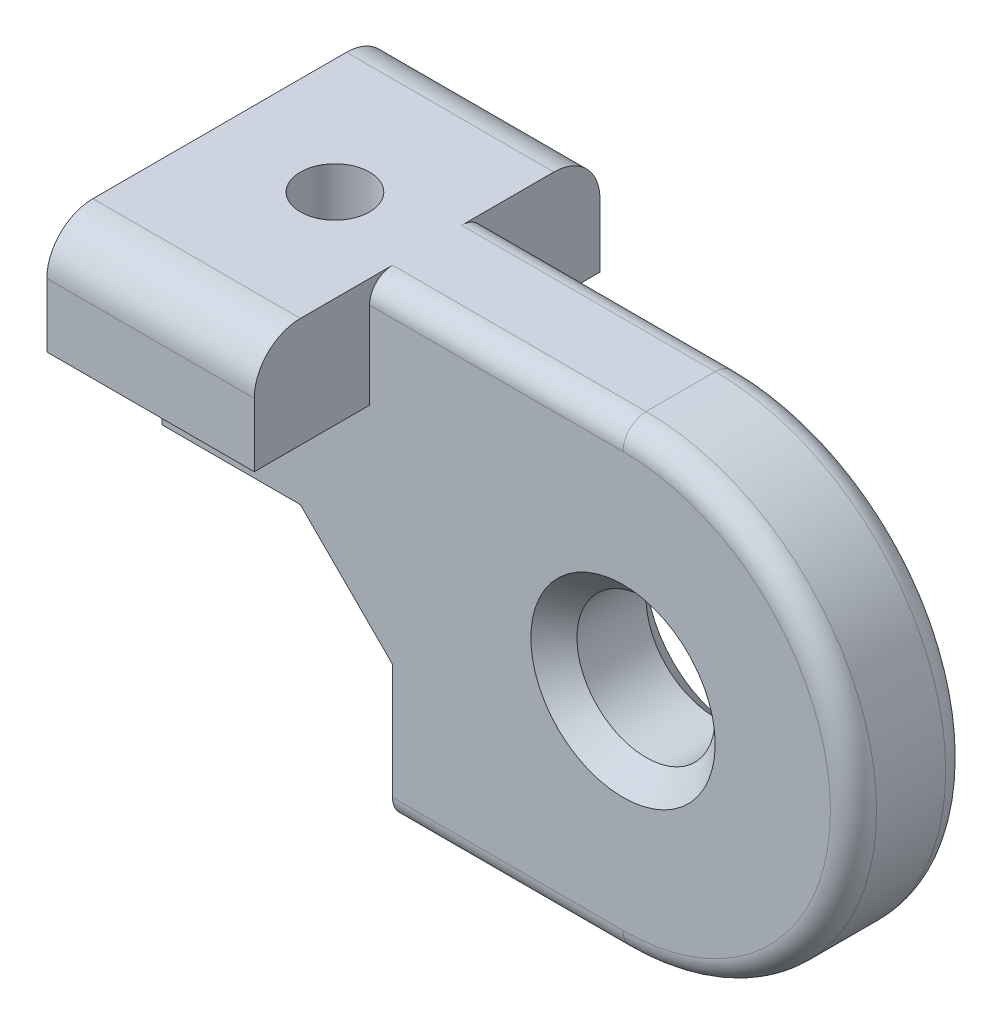
ISO-10303-21;
HEADER;
FILE_DESCRIPTION(('STEP AP214'),'2;1');
FILE_NAME('part.step','',(''),(''),'','','');
FILE_SCHEMA(('AUTOMOTIVE_DESIGN { 1 0 10303 214 1 1 1 1 }'));
ENDSEC;
DATA;
#1=APPLICATION_CONTEXT('core data for automotive mechanical design processes');
#2=APPLICATION_PROTOCOL_DEFINITION('international standard','automotive_design',2000,#1);
#3=PRODUCT_CONTEXT('',#1,'mechanical');
#4=PRODUCT('Part','Part','',(#3));
#5=PRODUCT_RELATED_PRODUCT_CATEGORY('part','',(#4));
#6=PRODUCT_DEFINITION_FORMATION('','',#4);
#7=PRODUCT_DEFINITION_CONTEXT('part definition',#1,'design');
#8=PRODUCT_DEFINITION('design','',#6,#7);
#9=PRODUCT_DEFINITION_SHAPE('','',#8);
#10=(LENGTH_UNIT() NAMED_UNIT(*) SI_UNIT(.MILLI.,.METRE.));
#11=(NAMED_UNIT(*) PLANE_ANGLE_UNIT() SI_UNIT($,.RADIAN.));
#12=(NAMED_UNIT(*) SI_UNIT($,.STERADIAN.) SOLID_ANGLE_UNIT());
#13=UNCERTAINTY_MEASURE_WITH_UNIT(LENGTH_MEASURE(1.E-05),#10,'distance_accuracy_value','');
#14=(GEOMETRIC_REPRESENTATION_CONTEXT(3) GLOBAL_UNCERTAINTY_ASSIGNED_CONTEXT((#13)) GLOBAL_UNIT_ASSIGNED_CONTEXT((#10,
#11,#12)) REPRESENTATION_CONTEXT('',''));
#15=CARTESIAN_POINT('',(0.,0.,0.));
#16=DIRECTION('',(0.,0.,1.));
#17=DIRECTION('',(1.,0.,0.));
#18=AXIS2_PLACEMENT_3D('',#15,#16,#17);
#19=CARTESIAN_POINT('',(0.,0.,2.5));
#20=DIRECTION('',(0.,0.,1.));
#21=DIRECTION('',(1.,0.,0.));
#22=AXIS2_PLACEMENT_3D('',#19,#20,#21);
#23=PLANE('',#22);
#24=DIRECTION('',(0.,-1.,0.));
#25=VECTOR('',#24,1.);
#26=CARTESIAN_POINT('',(-10.,-4.,2.5));
#27=LINE('',#26,#25);
#28=CARTESIAN_POINT('',(-10.,-4.,2.5));
#29=VERTEX_POINT('',#28);
#30=CARTESIAN_POINT('',(-10.,-9.,2.5));
#31=VERTEX_POINT('',#30);
#32=EDGE_CURVE('E297',#29,#31,#27,.T.);
#33=ORIENTED_EDGE('',*,*,#32,.T.);
#34=DIRECTION('',(1.,0.,0.));
#35=VECTOR('',#34,1.);
#36=CARTESIAN_POINT('',(0.,-9.,2.5));
#37=LINE('',#36,#35);
#38=CARTESIAN_POINT('',(0.,-9.,2.5));
#39=VERTEX_POINT('',#38);
#40=EDGE_CURVE('E247',#31,#39,#37,.T.);
#41=ORIENTED_EDGE('',*,*,#40,.T.);
#42=CARTESIAN_POINT('',(0.,0.,2.5));
#43=DIRECTION('',(0.,0.,1.));
#44=DIRECTION('',(1.,0.,0.));
#45=AXIS2_PLACEMENT_3D('',#42,#43,#44);
#46=CIRCLE('',#45,9.);
#47=CARTESIAN_POINT('',(0.,9.,2.5));
#48=VERTEX_POINT('',#47);
#49=EDGE_CURVE('E56',#39,#48,#46,.T.);
#50=ORIENTED_EDGE('',*,*,#49,.T.);
#51=DIRECTION('',(-1.,0.,0.));
#52=VECTOR('',#51,1.);
#53=CARTESIAN_POINT('',(-11.,9.,2.5));
#54=LINE('',#53,#52);
#55=CARTESIAN_POINT('',(-11.,9.,2.5));
#56=VERTEX_POINT('',#55);
#57=EDGE_CURVE('E245',#48,#56,#54,.T.);
#58=ORIENTED_EDGE('',*,*,#57,.T.);
#59=DIRECTION('',(0.,-1.,0.));
#60=VECTOR('',#59,1.);
#61=CARTESIAN_POINT('',(-11.,0.,2.5));
#62=LINE('',#61,#60);
#63=CARTESIAN_POINT('',(-11.,5.23809523809524,2.5));
#64=VERTEX_POINT('',#63);
#65=EDGE_CURVE('E275',#56,#64,#62,.T.);
#66=ORIENTED_EDGE('',*,*,#65,.T.);
#67=DIRECTION('',(-1.,0.,0.));
#68=VECTOR('',#67,1.);
#69=CARTESIAN_POINT('',(0.,5.23809523809524,2.5));
#70=LINE('',#69,#68);
#71=CARTESIAN_POINT('',(-20.,5.23809523809524,2.5));
#72=VERTEX_POINT('',#71);
#73=EDGE_CURVE('E289',#64,#72,#70,.T.);
#74=ORIENTED_EDGE('',*,*,#73,.T.);
#75=DIRECTION('',(0.,-1.,0.));
#76=VECTOR('',#75,1.);
#77=CARTESIAN_POINT('',(-20.,10.,2.5));
#78=LINE('',#77,#76);
#79=CARTESIAN_POINT('',(-20.,0.,2.5));
#80=VERTEX_POINT('',#79);
#81=EDGE_CURVE('E299',#72,#80,#78,.T.);
#82=ORIENTED_EDGE('',*,*,#81,.T.);
#83=DIRECTION('',(1.,0.,0.));
#84=VECTOR('',#83,1.);
#85=CARTESIAN_POINT('',(-20.,0.,2.5));
#86=LINE('',#85,#84);
#87=CARTESIAN_POINT('',(-14.,0.,2.5));
#88=VERTEX_POINT('',#87);
#89=EDGE_CURVE('E293',#80,#88,#86,.T.);
#90=ORIENTED_EDGE('',*,*,#89,.T.);
#91=DIRECTION('',(0.707106781186548,-0.707106781186548,0.));
#92=VECTOR('',#91,1.);
#93=CARTESIAN_POINT('',(-14.,0.,2.5));
#94=LINE('',#93,#92);
#95=EDGE_CURVE('E187',#88,#29,#94,.T.);
#96=ORIENTED_EDGE('',*,*,#95,.T.);
#97=EDGE_LOOP('',(#33,#41,#50,#58,#66,#74,#82,#90,#96));
#98=FACE_BOUND('',#97,.T.);
#99=CARTESIAN_POINT('',(0.,0.,2.5));
#100=DIRECTION('',(0.,0.,1.));
#101=DIRECTION('',(1.,0.,0.));
#102=AXIS2_PLACEMENT_3D('',#99,#100,#101);
#103=CIRCLE('',#102,4.00000000000001);
#104=CARTESIAN_POINT('',(4.00000000000001,0.,2.5));
#105=VERTEX_POINT('',#104);
#106=EDGE_CURVE('E221',#105,#105,#103,.F.);
#107=ORIENTED_EDGE('',*,*,#106,.T.);
#108=EDGE_LOOP('',(#107));
#109=FACE_BOUND('',#108,.T.);
#110=ADVANCED_FACE('F32',(#98,#109),#23,.T.);
#111=CARTESIAN_POINT('',(0.,0.,-2.5));
#112=DIRECTION('',(0.,0.,1.));
#113=DIRECTION('',(1.,0.,0.));
#114=AXIS2_PLACEMENT_3D('',#111,#112,#113);
#115=PLANE('',#114);
#116=CARTESIAN_POINT('',(0.,0.,-2.5));
#117=DIRECTION('',(0.,0.,1.));
#118=DIRECTION('',(1.,0.,0.));
#119=AXIS2_PLACEMENT_3D('',#116,#117,#118);
#120=CIRCLE('',#119,4.);
#121=CARTESIAN_POINT('',(4.,0.,-2.5));
#122=VERTEX_POINT('',#121);
#123=EDGE_CURVE('E212',#122,#122,#120,.T.);
#124=ORIENTED_EDGE('',*,*,#123,.T.);
#125=EDGE_LOOP('',(#124));
#126=FACE_BOUND('',#125,.T.);
#127=CARTESIAN_POINT('',(0.,0.,-2.5));
#128=DIRECTION('',(0.,0.,1.));
#129=DIRECTION('',(1.,0.,0.));
#130=AXIS2_PLACEMENT_3D('',#127,#128,#129);
#131=CIRCLE('',#130,9.);
#132=CARTESIAN_POINT('',(0.,9.,-2.5));
#133=VERTEX_POINT('',#132);
#134=CARTESIAN_POINT('',(0.,-9.,-2.5));
#135=VERTEX_POINT('',#134);
#136=EDGE_CURVE('E229',#133,#135,#131,.F.);
#137=ORIENTED_EDGE('',*,*,#136,.T.);
#138=DIRECTION('',(1.,0.,0.));
#139=VECTOR('',#138,1.);
#140=CARTESIAN_POINT('',(0.,-9.,-2.5));
#141=LINE('',#140,#139);
#142=CARTESIAN_POINT('',(-10.,-9.,-2.5));
#143=VERTEX_POINT('',#142);
#144=EDGE_CURVE('E233',#135,#143,#141,.F.);
#145=ORIENTED_EDGE('',*,*,#144,.T.);
#146=DIRECTION('',(0.,-1.,0.));
#147=VECTOR('',#146,1.);
#148=CARTESIAN_POINT('',(-10.,-4.,-2.5));
#149=LINE('',#148,#147);
#150=CARTESIAN_POINT('',(-10.,-4.,-2.5));
#151=VERTEX_POINT('',#150);
#152=EDGE_CURVE('E303',#151,#143,#149,.T.);
#153=ORIENTED_EDGE('',*,*,#152,.F.);
#154=DIRECTION('',(0.707106781186548,-0.707106781186548,0.));
#155=VECTOR('',#154,1.);
#156=CARTESIAN_POINT('',(-14.,0.,-2.5));
#157=LINE('',#156,#155);
#158=CARTESIAN_POINT('',(-14.,0.,-2.5));
#159=VERTEX_POINT('',#158);
#160=EDGE_CURVE('E287',#159,#151,#157,.T.);
#161=ORIENTED_EDGE('',*,*,#160,.F.);
#162=DIRECTION('',(1.,0.,0.));
#163=VECTOR('',#162,1.);
#164=CARTESIAN_POINT('',(-20.,0.,-2.5));
#165=LINE('',#164,#163);
#166=CARTESIAN_POINT('',(-20.,0.,-2.5));
#167=VERTEX_POINT('',#166);
#168=EDGE_CURVE('E284',#167,#159,#165,.T.);
#169=ORIENTED_EDGE('',*,*,#168,.F.);
#170=DIRECTION('',(0.,-1.,0.));
#171=VECTOR('',#170,1.);
#172=CARTESIAN_POINT('',(-20.,10.,-2.5));
#173=LINE('',#172,#171);
#174=CARTESIAN_POINT('',(-20.,5.23809523809524,-2.5));
#175=VERTEX_POINT('',#174);
#176=EDGE_CURVE('E295',#175,#167,#173,.T.);
#177=ORIENTED_EDGE('',*,*,#176,.F.);
#178=DIRECTION('',(-1.,0.,0.));
#179=VECTOR('',#178,1.);
#180=CARTESIAN_POINT('',(0.,5.23809523809524,-2.5));
#181=LINE('',#180,#179);
#182=CARTESIAN_POINT('',(-11.,5.23809523809524,-2.5));
#183=VERTEX_POINT('',#182);
#184=EDGE_CURVE('E361',#183,#175,#181,.T.);
#185=ORIENTED_EDGE('',*,*,#184,.F.);
#186=DIRECTION('',(0.,-1.,0.));
#187=VECTOR('',#186,1.);
#188=CARTESIAN_POINT('',(-11.,0.,-2.5));
#189=LINE('',#188,#187);
#190=CARTESIAN_POINT('',(-11.,9.,-2.5));
#191=VERTEX_POINT('',#190);
#192=EDGE_CURVE('E285',#191,#183,#189,.T.);
#193=ORIENTED_EDGE('',*,*,#192,.F.);
#194=DIRECTION('',(-1.,0.,0.));
#195=VECTOR('',#194,1.);
#196=CARTESIAN_POINT('',(0.,9.,-2.5));
#197=LINE('',#196,#195);
#198=EDGE_CURVE('E231',#191,#133,#197,.F.);
#199=ORIENTED_EDGE('',*,*,#198,.T.);
#200=EDGE_LOOP('',(#137,#145,#153,#161,#169,#177,#185,#193,#199));
#201=FACE_BOUND('',#200,.T.);
#202=ADVANCED_FACE('F330',(#126,#201),#115,.F.);
#203=CARTESIAN_POINT('',(-20.,0.,2.5));
#204=DIRECTION('',(0.,1.,0.));
#205=DIRECTION('',(0.,0.,1.));
#206=AXIS2_PLACEMENT_3D('',#203,#204,#205);
#207=PLANE('',#206);
#208=DIRECTION('',(0.,0.,-1.));
#209=VECTOR('',#208,1.);
#210=CARTESIAN_POINT('',(-14.,0.,2.5));
#211=LINE('',#210,#209);
#212=CARTESIAN_POINT('',(-14.,0.,-1.1180339887499));
#213=VERTEX_POINT('',#212);
#214=EDGE_CURVE('E182',#213,#159,#211,.T.);
#215=ORIENTED_EDGE('',*,*,#214,.F.);
#216=CARTESIAN_POINT('',(-15.,0.,0.));
#217=DIRECTION('',(0.,1.,0.));
#218=DIRECTION('',(0.,0.,1.));
#219=AXIS2_PLACEMENT_3D('',#216,#217,#218);
#220=CIRCLE('',#219,1.5);
#221=CARTESIAN_POINT('',(-14.,0.,1.1180339887499));
#222=VERTEX_POINT('',#221);
#223=EDGE_CURVE('E48',#213,#222,#220,.T.);
#224=ORIENTED_EDGE('',*,*,#223,.T.);
#225=EDGE_CURVE('E180',#88,#222,#211,.T.);
#226=ORIENTED_EDGE('',*,*,#225,.F.);
#227=ORIENTED_EDGE('',*,*,#89,.F.);
#228=DIRECTION('',(0.,0.,-1.));
#229=VECTOR('',#228,1.);
#230=CARTESIAN_POINT('',(-20.,0.,2.5));
#231=LINE('',#230,#229);
#232=EDGE_CURVE('E300',#80,#167,#231,.T.);
#233=ORIENTED_EDGE('',*,*,#232,.T.);
#234=ORIENTED_EDGE('',*,*,#168,.T.);
#235=EDGE_LOOP('',(#215,#224,#226,#227,#233,#234));
#236=FACE_BOUND('',#235,.T.);
#237=ADVANCED_FACE('F178',(#236),#207,.F.);
#238=CARTESIAN_POINT('',(-14.,0.,2.5));
#239=DIRECTION('',(0.707106781186548,0.707106781186548,0.));
#240=DIRECTION('',(-0.707106781186548,0.707106781186548,0.));
#241=AXIS2_PLACEMENT_3D('',#238,#239,#240);
#242=PLANE('',#241);
#243=ORIENTED_EDGE('',*,*,#225,.T.);
#244=CARTESIAN_POINT('',(-15.,0.999999999999999,0.));
#245=DIRECTION('',(0.707106781186548,0.707106781186548,0.));
#246=DIRECTION('',(-0.707106781186548,0.707106781186548,0.));
#247=AXIS2_PLACEMENT_3D('',#244,#245,#246);
#248=ELLIPSE('',#247,2.12132034355964,1.5);
#249=EDGE_CURVE('E169',#222,#213,#248,.T.);
#250=ORIENTED_EDGE('',*,*,#249,.T.);
#251=ORIENTED_EDGE('',*,*,#214,.T.);
#252=ORIENTED_EDGE('',*,*,#160,.T.);
#253=DIRECTION('',(0.,0.,-1.));
#254=VECTOR('',#253,1.);
#255=CARTESIAN_POINT('',(-10.,-4.,2.5));
#256=LINE('',#255,#254);
#257=EDGE_CURVE('E193',#29,#151,#256,.T.);
#258=ORIENTED_EDGE('',*,*,#257,.F.);
#259=ORIENTED_EDGE('',*,*,#95,.F.);
#260=EDGE_LOOP('',(#243,#250,#251,#252,#258,#259));
#261=FACE_BOUND('',#260,.T.);
#262=ADVANCED_FACE('F185',(#261),#242,.F.);
#263=CARTESIAN_POINT('',(-10.,-4.,2.5));
#264=DIRECTION('',(1.,0.,0.));
#265=DIRECTION('',(0.,0.,-1.));
#266=AXIS2_PLACEMENT_3D('',#263,#264,#265);
#267=PLANE('',#266);
#268=ORIENTED_EDGE('',*,*,#152,.T.);
#269=CARTESIAN_POINT('',(-10.,-9.,-1.5));
#270=DIRECTION('',(1.,0.,0.));
#271=DIRECTION('',(0.,0.,-1.));
#272=AXIS2_PLACEMENT_3D('',#269,#270,#271);
#273=CIRCLE('',#272,1.);
#274=CARTESIAN_POINT('',(-10.,-10.,-1.5));
#275=VERTEX_POINT('',#274);
#276=EDGE_CURVE('E237',#143,#275,#273,.F.);
#277=ORIENTED_EDGE('',*,*,#276,.T.);
#278=DIRECTION('',(0.,0.,-1.));
#279=VECTOR('',#278,1.);
#280=CARTESIAN_POINT('',(-10.,-10.,2.5));
#281=LINE('',#280,#279);
#282=CARTESIAN_POINT('',(-10.,-10.,1.5));
#283=VERTEX_POINT('',#282);
#284=EDGE_CURVE('E317',#283,#275,#281,.T.);
#285=ORIENTED_EDGE('',*,*,#284,.F.);
#286=CARTESIAN_POINT('',(-10.,-9.,1.5));
#287=DIRECTION('',(1.,0.,0.));
#288=DIRECTION('',(0.,0.,-1.));
#289=AXIS2_PLACEMENT_3D('',#286,#287,#288);
#290=CIRCLE('',#289,1.);
#291=EDGE_CURVE('E235',#283,#31,#290,.F.);
#292=ORIENTED_EDGE('',*,*,#291,.T.);
#293=ORIENTED_EDGE('',*,*,#32,.F.);
#294=ORIENTED_EDGE('',*,*,#257,.T.);
#295=EDGE_LOOP('',(#268,#277,#285,#292,#293,#294));
#296=FACE_BOUND('',#295,.T.);
#297=ADVANCED_FACE('F326',(#296),#267,.F.);
#298=CARTESIAN_POINT('',(-10.,-10.,2.5));
#299=DIRECTION('',(0.,1.,0.));
#300=DIRECTION('',(0.,0.,1.));
#301=AXIS2_PLACEMENT_3D('',#298,#299,#300);
#302=PLANE('',#301);
#303=ORIENTED_EDGE('',*,*,#284,.T.);
#304=DIRECTION('',(1.,0.,0.));
#305=VECTOR('',#304,1.);
#306=CARTESIAN_POINT('',(-10.,-10.,-1.5));
#307=LINE('',#306,#305);
#308=CARTESIAN_POINT('',(0.,-10.,-1.5));
#309=VERTEX_POINT('',#308);
#310=EDGE_CURVE('E226',#275,#309,#307,.T.);
#311=ORIENTED_EDGE('',*,*,#310,.T.);
#312=DIRECTION('',(0.,0.,-1.));
#313=VECTOR('',#312,1.);
#314=CARTESIAN_POINT('',(0.,-10.,2.5));
#315=LINE('',#314,#313);
#316=CARTESIAN_POINT('',(0.,-10.,1.5));
#317=VERTEX_POINT('',#316);
#318=EDGE_CURVE('E315',#317,#309,#315,.T.);
#319=ORIENTED_EDGE('',*,*,#318,.F.);
#320=DIRECTION('',(1.,0.,0.));
#321=VECTOR('',#320,1.);
#322=CARTESIAN_POINT('',(-10.,-10.,1.5));
#323=LINE('',#322,#321);
#324=EDGE_CURVE('E224',#317,#283,#323,.F.);
#325=ORIENTED_EDGE('',*,*,#324,.T.);
#326=EDGE_LOOP('',(#303,#311,#319,#325));
#327=FACE_BOUND('',#326,.T.);
#328=ADVANCED_FACE('F344',(#327),#302,.F.);
#329=CARTESIAN_POINT('',(0.,0.,2.5));
#330=DIRECTION('',(0.,0.,-1.));
#331=DIRECTION('',(-1.,0.,0.));
#332=AXIS2_PLACEMENT_3D('',#329,#330,#331);
#333=CYLINDRICAL_SURFACE('',#332,10.);
#334=ORIENTED_EDGE('',*,*,#318,.T.);
#335=CARTESIAN_POINT('',(0.,0.,-1.5));
#336=DIRECTION('',(0.,0.,1.));
#337=DIRECTION('',(1.,0.,0.));
#338=AXIS2_PLACEMENT_3D('',#335,#336,#337);
#339=CIRCLE('',#338,10.);
#340=CARTESIAN_POINT('',(0.,10.,-1.5));
#341=VERTEX_POINT('',#340);
#342=EDGE_CURVE('E251',#309,#341,#339,.T.);
#343=ORIENTED_EDGE('',*,*,#342,.T.);
#344=DIRECTION('',(0.,0.,-1.));
#345=VECTOR('',#344,1.);
#346=CARTESIAN_POINT('',(0.,10.,2.5));
#347=LINE('',#346,#345);
#348=CARTESIAN_POINT('',(0.,10.,1.5));
#349=VERTEX_POINT('',#348);
#350=EDGE_CURVE('E312',#349,#341,#347,.T.);
#351=ORIENTED_EDGE('',*,*,#350,.F.);
#352=CARTESIAN_POINT('',(0.,0.,1.5));
#353=DIRECTION('',(0.,0.,1.));
#354=DIRECTION('',(1.,0.,0.));
#355=AXIS2_PLACEMENT_3D('',#352,#353,#354);
#356=CIRCLE('',#355,10.);
#357=EDGE_CURVE('E249',#349,#317,#356,.F.);
#358=ORIENTED_EDGE('',*,*,#357,.T.);
#359=EDGE_LOOP('',(#334,#343,#351,#358));
#360=FACE_BOUND('',#359,.T.);
#361=ADVANCED_FACE('F345',(#360),#333,.T.);
#362=CARTESIAN_POINT('',(0.,10.,2.5));
#363=DIRECTION('',(0.,-1.,0.));
#364=DIRECTION('',(0.,0.,-1.));
#365=AXIS2_PLACEMENT_3D('',#362,#363,#364);
#366=PLANE('',#365);
#367=CARTESIAN_POINT('',(-15.,10.,0.));
#368=DIRECTION('',(0.,1.,0.));
#369=DIRECTION('',(0.,0.,1.));
#370=AXIS2_PLACEMENT_3D('',#367,#368,#369);
#371=CIRCLE('',#370,1.5);
#372=CARTESIAN_POINT('',(-15.,10.,1.5));
#373=VERTEX_POINT('',#372);
#374=EDGE_CURVE('E174',#373,#373,#371,.T.);
#375=ORIENTED_EDGE('',*,*,#374,.F.);
#376=EDGE_LOOP('',(#375));
#377=FACE_BOUND('',#376,.T.);
#378=ORIENTED_EDGE('',*,*,#350,.T.);
#379=DIRECTION('',(-1.,0.,0.));
#380=VECTOR('',#379,1.);
#381=CARTESIAN_POINT('',(0.,10.,-1.5));
#382=LINE('',#381,#380);
#383=CARTESIAN_POINT('',(-11.,10.,-1.5));
#384=VERTEX_POINT('',#383);
#385=EDGE_CURVE('E241',#341,#384,#382,.T.);
#386=ORIENTED_EDGE('',*,*,#385,.T.);
#387=DIRECTION('',(0.,0.,-1.));
#388=VECTOR('',#387,1.);
#389=CARTESIAN_POINT('',(-11.,10.,7.5));
#390=LINE('',#389,#388);
#391=CARTESIAN_POINT('',(-11.,10.,-5.5));
#392=VERTEX_POINT('',#391);
#393=EDGE_CURVE('E359',#384,#392,#390,.T.);
#394=ORIENTED_EDGE('',*,*,#393,.T.);
#395=DIRECTION('',(-1.,0.,0.));
#396=VECTOR('',#395,1.);
#397=CARTESIAN_POINT('',(0.,10.,-5.5));
#398=LINE('',#397,#396);
#399=CARTESIAN_POINT('',(-20.,10.,-5.5));
#400=VERTEX_POINT('',#399);
#401=EDGE_CURVE('E191',#392,#400,#398,.T.);
#402=ORIENTED_EDGE('',*,*,#401,.T.);
#403=DIRECTION('',(0.,0.,-1.));
#404=VECTOR('',#403,1.);
#405=CARTESIAN_POINT('',(-20.,10.,2.5));
#406=LINE('',#405,#404);
#407=CARTESIAN_POINT('',(-20.,10.,5.5));
#408=VERTEX_POINT('',#407);
#409=EDGE_CURVE('E309',#408,#400,#406,.T.);
#410=ORIENTED_EDGE('',*,*,#409,.F.);
#411=DIRECTION('',(-1.,0.,0.));
#412=VECTOR('',#411,1.);
#413=CARTESIAN_POINT('',(-11.,10.,5.5));
#414=LINE('',#413,#412);
#415=CARTESIAN_POINT('',(-11.,10.,5.5));
#416=VERTEX_POINT('',#415);
#417=EDGE_CURVE('E189',#408,#416,#414,.F.);
#418=ORIENTED_EDGE('',*,*,#417,.T.);
#419=CARTESIAN_POINT('',(-11.,10.,1.5));
#420=VERTEX_POINT('',#419);
#421=EDGE_CURVE('E374',#416,#420,#390,.T.);
#422=ORIENTED_EDGE('',*,*,#421,.T.);
#423=DIRECTION('',(-1.,0.,0.));
#424=VECTOR('',#423,1.);
#425=CARTESIAN_POINT('',(0.,10.,1.5));
#426=LINE('',#425,#424);
#427=EDGE_CURVE('E239',#420,#349,#426,.F.);
#428=ORIENTED_EDGE('',*,*,#427,.T.);
#429=EDGE_LOOP('',(#378,#386,#394,#402,#410,#418,#422,#428));
#430=FACE_BOUND('',#429,.T.);
#431=ADVANCED_FACE('F348',(#377,#430),#366,.F.);
#432=CARTESIAN_POINT('',(-20.,10.,2.5));
#433=DIRECTION('',(1.,0.,0.));
#434=DIRECTION('',(0.,0.,-1.));
#435=AXIS2_PLACEMENT_3D('',#432,#433,#434);
#436=PLANE('',#435);
#437=ORIENTED_EDGE('',*,*,#409,.T.);
#438=CARTESIAN_POINT('',(-20.,8.,-5.5));
#439=DIRECTION('',(1.,0.,0.));
#440=DIRECTION('',(0.,0.,-1.));
#441=AXIS2_PLACEMENT_3D('',#438,#439,#440);
#442=CIRCLE('',#441,2.);
#443=CARTESIAN_POINT('',(-20.,8.,-7.5));
#444=VERTEX_POINT('',#443);
#445=EDGE_CURVE('E201',#400,#444,#442,.F.);
#446=ORIENTED_EDGE('',*,*,#445,.T.);
#447=DIRECTION('',(0.,-1.,0.));
#448=VECTOR('',#447,1.);
#449=CARTESIAN_POINT('',(-20.,10.,-7.5));
#450=LINE('',#449,#448);
#451=CARTESIAN_POINT('',(-20.,5.23809523809524,-7.5));
#452=VERTEX_POINT('',#451);
#453=EDGE_CURVE('E258',#444,#452,#450,.T.);
#454=ORIENTED_EDGE('',*,*,#453,.T.);
#455=DIRECTION('',(0.,0.,-1.));
#456=VECTOR('',#455,1.);
#457=CARTESIAN_POINT('',(-20.,5.23809523809524,7.5));
#458=LINE('',#457,#456);
#459=EDGE_CURVE('E376',#175,#452,#458,.T.);
#460=ORIENTED_EDGE('',*,*,#459,.F.);
#461=ORIENTED_EDGE('',*,*,#176,.T.);
#462=ORIENTED_EDGE('',*,*,#232,.F.);
#463=ORIENTED_EDGE('',*,*,#81,.F.);
#464=CARTESIAN_POINT('',(-20.,5.23809523809524,7.5));
#465=VERTEX_POINT('',#464);
#466=EDGE_CURVE('E366',#465,#72,#458,.T.);
#467=ORIENTED_EDGE('',*,*,#466,.F.);
#468=DIRECTION('',(0.,-1.,0.));
#469=VECTOR('',#468,1.);
#470=CARTESIAN_POINT('',(-20.,10.,7.5));
#471=LINE('',#470,#469);
#472=CARTESIAN_POINT('',(-20.,8.,7.5));
#473=VERTEX_POINT('',#472);
#474=EDGE_CURVE('E634',#473,#465,#471,.T.);
#475=ORIENTED_EDGE('',*,*,#474,.F.);
#476=CARTESIAN_POINT('',(-20.,8.,5.5));
#477=DIRECTION('',(1.,0.,0.));
#478=DIRECTION('',(0.,0.,-1.));
#479=AXIS2_PLACEMENT_3D('',#476,#477,#478);
#480=CIRCLE('',#479,2.);
#481=EDGE_CURVE('E199',#473,#408,#480,.F.);
#482=ORIENTED_EDGE('',*,*,#481,.T.);
#483=EDGE_LOOP('',(#437,#446,#454,#460,#461,#462,#463,#467,#475,#482));
#484=FACE_BOUND('',#483,.T.);
#485=ADVANCED_FACE('F385',(#484),#436,.F.);
#486=CARTESIAN_POINT('',(0.,0.,2.5));
#487=DIRECTION('',(0.,0.,-1.));
#488=DIRECTION('',(-1.,0.,0.));
#489=AXIS2_PLACEMENT_3D('',#486,#487,#488);
#490=CYLINDRICAL_SURFACE('',#489,3.);
#491=CARTESIAN_POINT('',(0.,0.,-1.5));
#492=DIRECTION('',(0.,0.,1.));
#493=DIRECTION('',(1.,0.,0.));
#494=AXIS2_PLACEMENT_3D('',#491,#492,#493);
#495=CIRCLE('',#494,3.);
#496=CARTESIAN_POINT('',(3.,0.,-1.5));
#497=VERTEX_POINT('',#496);
#498=EDGE_CURVE('E218',#497,#497,#495,.F.);
#499=ORIENTED_EDGE('',*,*,#498,.T.);
#500=EDGE_LOOP('',(#499));
#501=FACE_BOUND('',#500,.T.);
#502=CARTESIAN_POINT('',(0.,0.,1.5));
#503=DIRECTION('',(0.,0.,1.));
#504=DIRECTION('',(1.,0.,0.));
#505=AXIS2_PLACEMENT_3D('',#502,#503,#504);
#506=CIRCLE('',#505,3.);
#507=CARTESIAN_POINT('',(3.,0.,1.5));
#508=VERTEX_POINT('',#507);
#509=EDGE_CURVE('E215',#508,#508,#506,.T.);
#510=ORIENTED_EDGE('',*,*,#509,.T.);
#511=EDGE_LOOP('',(#510));
#512=FACE_BOUND('',#511,.T.);
#513=ADVANCED_FACE('F407',(#501,#512),#490,.F.);
#514=CARTESIAN_POINT('',(0.,0.,-7.5));
#515=DIRECTION('',(0.,0.,1.));
#516=DIRECTION('',(1.,0.,0.));
#517=AXIS2_PLACEMENT_3D('',#514,#515,#516);
#518=PLANE('',#517);
#519=ORIENTED_EDGE('',*,*,#453,.F.);
#520=DIRECTION('',(-1.,0.,0.));
#521=VECTOR('',#520,1.);
#522=CARTESIAN_POINT('',(0.,8.,-7.5));
#523=LINE('',#522,#521);
#524=CARTESIAN_POINT('',(-11.,8.,-7.5));
#525=VERTEX_POINT('',#524);
#526=EDGE_CURVE('E203',#444,#525,#523,.F.);
#527=ORIENTED_EDGE('',*,*,#526,.T.);
#528=DIRECTION('',(0.,1.,0.));
#529=VECTOR('',#528,1.);
#530=CARTESIAN_POINT('',(-11.,5.23809523809524,-7.5));
#531=LINE('',#530,#529);
#532=CARTESIAN_POINT('',(-11.,5.23809523809524,-7.5));
#533=VERTEX_POINT('',#532);
#534=EDGE_CURVE('E640',#533,#525,#531,.T.);
#535=ORIENTED_EDGE('',*,*,#534,.F.);
#536=DIRECTION('',(1.,0.,0.));
#537=VECTOR('',#536,1.);
#538=CARTESIAN_POINT('',(-20.,5.23809523809524,-7.5));
#539=LINE('',#538,#537);
#540=EDGE_CURVE('E372',#452,#533,#539,.T.);
#541=ORIENTED_EDGE('',*,*,#540,.F.);
#542=EDGE_LOOP('',(#519,#527,#535,#541));
#543=FACE_BOUND('',#542,.T.);
#544=ADVANCED_FACE('F515',(#543),#518,.F.);
#545=CARTESIAN_POINT('',(-11.,5.23809523809524,7.5));
#546=DIRECTION('',(-1.,0.,0.));
#547=DIRECTION('',(0.,0.,1.));
#548=AXIS2_PLACEMENT_3D('',#545,#546,#547);
#549=PLANE('',#548);
#550=ORIENTED_EDGE('',*,*,#534,.T.);
#551=CARTESIAN_POINT('',(-11.,8.,-5.5));
#552=DIRECTION('',(-1.,0.,0.));
#553=DIRECTION('',(0.,0.,1.));
#554=AXIS2_PLACEMENT_3D('',#551,#552,#553);
#555=CIRCLE('',#554,2.);
#556=EDGE_CURVE('E205',#525,#392,#555,.F.);
#557=ORIENTED_EDGE('',*,*,#556,.T.);
#558=ORIENTED_EDGE('',*,*,#393,.F.);
#559=CARTESIAN_POINT('',(-11.,9.,-1.5));
#560=DIRECTION('',(-1.,0.,0.));
#561=DIRECTION('',(0.,0.,1.));
#562=AXIS2_PLACEMENT_3D('',#559,#560,#561);
#563=CIRCLE('',#562,1.);
#564=EDGE_CURVE('E41',#384,#191,#563,.T.);
#565=ORIENTED_EDGE('',*,*,#564,.T.);
#566=ORIENTED_EDGE('',*,*,#192,.T.);
#567=DIRECTION('',(0.,0.,-1.));
#568=VECTOR('',#567,1.);
#569=CARTESIAN_POINT('',(-11.,5.23809523809524,7.5));
#570=LINE('',#569,#568);
#571=EDGE_CURVE('E369',#183,#533,#570,.T.);
#572=ORIENTED_EDGE('',*,*,#571,.T.);
#573=EDGE_LOOP('',(#550,#557,#558,#565,#566,#572));
#574=FACE_BOUND('',#573,.T.);
#575=ADVANCED_FACE('F357',(#574),#549,.F.);
#576=CARTESIAN_POINT('',(-20.,5.23809523809524,7.5));
#577=DIRECTION('',(0.,1.,0.));
#578=DIRECTION('',(0.,0.,1.));
#579=AXIS2_PLACEMENT_3D('',#576,#577,#578);
#580=PLANE('',#579);
#581=ORIENTED_EDGE('',*,*,#571,.F.);
#582=ORIENTED_EDGE('',*,*,#184,.T.);
#583=ORIENTED_EDGE('',*,*,#459,.T.);
#584=ORIENTED_EDGE('',*,*,#540,.T.);
#585=EDGE_LOOP('',(#581,#582,#583,#584));
#586=FACE_BOUND('',#585,.T.);
#587=ADVANCED_FACE('F370',(#586),#580,.F.);
#588=ORIENTED_EDGE('',*,*,#73,.F.);
#589=CARTESIAN_POINT('',(-11.,5.23809523809524,7.5));
#590=VERTEX_POINT('',#589);
#591=EDGE_CURVE('E282',#590,#64,#570,.T.);
#592=ORIENTED_EDGE('',*,*,#591,.F.);
#593=DIRECTION('',(1.,0.,0.));
#594=VECTOR('',#593,1.);
#595=CARTESIAN_POINT('',(-20.,5.23809523809524,7.5));
#596=LINE('',#595,#594);
#597=EDGE_CURVE('E629',#465,#590,#596,.T.);
#598=ORIENTED_EDGE('',*,*,#597,.F.);
#599=ORIENTED_EDGE('',*,*,#466,.T.);
#600=EDGE_LOOP('',(#588,#592,#598,#599));
#601=FACE_BOUND('',#600,.T.);
#602=ADVANCED_FACE('F537',(#601),#580,.F.);
#603=ORIENTED_EDGE('',*,*,#421,.F.);
#604=CARTESIAN_POINT('',(-11.,8.,5.5));
#605=DIRECTION('',(-1.,0.,0.));
#606=DIRECTION('',(0.,0.,1.));
#607=AXIS2_PLACEMENT_3D('',#604,#605,#606);
#608=CIRCLE('',#607,2.);
#609=CARTESIAN_POINT('',(-11.,8.,7.5));
#610=VERTEX_POINT('',#609);
#611=EDGE_CURVE('E210',#416,#610,#608,.F.);
#612=ORIENTED_EDGE('',*,*,#611,.T.);
#613=DIRECTION('',(0.,1.,0.));
#614=VECTOR('',#613,1.);
#615=CARTESIAN_POINT('',(-11.,5.23809523809524,7.5));
#616=LINE('',#615,#614);
#617=EDGE_CURVE('E627',#590,#610,#616,.T.);
#618=ORIENTED_EDGE('',*,*,#617,.F.);
#619=ORIENTED_EDGE('',*,*,#591,.T.);
#620=ORIENTED_EDGE('',*,*,#65,.F.);
#621=CARTESIAN_POINT('',(-11.,9.,1.5));
#622=DIRECTION('',(-1.,0.,0.));
#623=DIRECTION('',(0.,0.,1.));
#624=AXIS2_PLACEMENT_3D('',#621,#622,#623);
#625=CIRCLE('',#624,1.);
#626=EDGE_CURVE('E11',#56,#420,#625,.T.);
#627=ORIENTED_EDGE('',*,*,#626,.T.);
#628=EDGE_LOOP('',(#603,#612,#618,#619,#620,#627));
#629=FACE_BOUND('',#628,.T.);
#630=ADVANCED_FACE('F279',(#629),#549,.F.);
#631=CARTESIAN_POINT('',(0.,0.,7.5));
#632=DIRECTION('',(0.,0.,1.));
#633=DIRECTION('',(1.,0.,0.));
#634=AXIS2_PLACEMENT_3D('',#631,#632,#633);
#635=PLANE('',#634);
#636=ORIENTED_EDGE('',*,*,#617,.T.);
#637=DIRECTION('',(-1.,0.,0.));
#638=VECTOR('',#637,1.);
#639=CARTESIAN_POINT('',(-20.,8.,7.5));
#640=LINE('',#639,#638);
#641=EDGE_CURVE('E207',#610,#473,#640,.T.);
#642=ORIENTED_EDGE('',*,*,#641,.T.);
#643=ORIENTED_EDGE('',*,*,#474,.T.);
#644=ORIENTED_EDGE('',*,*,#597,.T.);
#645=EDGE_LOOP('',(#636,#642,#643,#644));
#646=FACE_BOUND('',#645,.T.);
#647=ADVANCED_FACE('F429',(#646),#635,.T.);
#648=CARTESIAN_POINT('',(0.,8.,-5.5));
#649=DIRECTION('',(-1.,0.,0.));
#650=DIRECTION('',(0.,0.,1.));
#651=AXIS2_PLACEMENT_3D('',#648,#649,#650);
#652=CYLINDRICAL_SURFACE('',#651,2.);
#653=ORIENTED_EDGE('',*,*,#556,.F.);
#654=ORIENTED_EDGE('',*,*,#526,.F.);
#655=ORIENTED_EDGE('',*,*,#445,.F.);
#656=ORIENTED_EDGE('',*,*,#401,.F.);
#657=EDGE_LOOP('',(#653,#654,#655,#656));
#658=FACE_BOUND('',#657,.T.);
#659=ADVANCED_FACE('F425',(#658),#652,.T.);
#660=CARTESIAN_POINT('',(0.,8.,5.5));
#661=DIRECTION('',(1.,0.,0.));
#662=DIRECTION('',(0.,0.,-1.));
#663=AXIS2_PLACEMENT_3D('',#660,#661,#662);
#664=CYLINDRICAL_SURFACE('',#663,2.);
#665=ORIENTED_EDGE('',*,*,#611,.F.);
#666=ORIENTED_EDGE('',*,*,#417,.F.);
#667=ORIENTED_EDGE('',*,*,#481,.F.);
#668=ORIENTED_EDGE('',*,*,#641,.F.);
#669=EDGE_LOOP('',(#665,#666,#667,#668));
#670=FACE_BOUND('',#669,.T.);
#671=ADVANCED_FACE('F428',(#670),#664,.T.);
#672=CARTESIAN_POINT('',(0.,0.,-2.5));
#673=DIRECTION('',(0.,0.,-1.));
#674=DIRECTION('',(-1.,0.,0.));
#675=AXIS2_PLACEMENT_3D('',#672,#673,#674);
#676=CONICAL_SURFACE('',#675,4.,0.785398163397447);
#677=ORIENTED_EDGE('',*,*,#498,.F.);
#678=EDGE_LOOP('',(#677));
#679=FACE_BOUND('',#678,.T.);
#680=ORIENTED_EDGE('',*,*,#123,.F.);
#681=EDGE_LOOP('',(#680));
#682=FACE_BOUND('',#681,.T.);
#683=ADVANCED_FACE('F433',(#679,#682),#676,.F.);
#684=CARTESIAN_POINT('',(0.,0.,1.5));
#685=DIRECTION('',(0.,0.,1.));
#686=DIRECTION('',(1.,0.,0.));
#687=AXIS2_PLACEMENT_3D('',#684,#685,#686);
#688=CONICAL_SURFACE('',#687,3.,0.785398163397453);
#689=ORIENTED_EDGE('',*,*,#106,.F.);
#690=EDGE_LOOP('',(#689));
#691=FACE_BOUND('',#690,.T.);
#692=ORIENTED_EDGE('',*,*,#509,.F.);
#693=EDGE_LOOP('',(#692));
#694=FACE_BOUND('',#693,.T.);
#695=ADVANCED_FACE('F437',(#691,#694),#688,.F.);
#696=CARTESIAN_POINT('',(0.,9.,-1.5));
#697=DIRECTION('',(-1.,0.,0.));
#698=DIRECTION('',(0.,0.,1.));
#699=AXIS2_PLACEMENT_3D('',#696,#697,#698);
#700=CYLINDRICAL_SURFACE('',#699,1.);
#701=ORIENTED_EDGE('',*,*,#564,.F.);
#702=ORIENTED_EDGE('',*,*,#385,.F.);
#703=CARTESIAN_POINT('',(0.,9.,-1.5));
#704=DIRECTION('',(1.,0.,0.));
#705=DIRECTION('',(0.,0.,-1.));
#706=AXIS2_PLACEMENT_3D('',#703,#704,#705);
#707=CIRCLE('',#706,1.);
#708=EDGE_CURVE('E256',#133,#341,#707,.T.);
#709=ORIENTED_EDGE('',*,*,#708,.F.);
#710=ORIENTED_EDGE('',*,*,#198,.F.);
#711=EDGE_LOOP('',(#701,#702,#709,#710));
#712=FACE_BOUND('',#711,.T.);
#713=ADVANCED_FACE('F352',(#712),#700,.T.);
#714=CARTESIAN_POINT('',(0.,0.,-1.5));
#715=DIRECTION('',(0.,0.,1.));
#716=DIRECTION('',(1.,0.,0.));
#717=AXIS2_PLACEMENT_3D('',#714,#715,#716);
#718=TOROIDAL_SURFACE('',#717,9.,1.);
#719=ORIENTED_EDGE('',*,*,#708,.T.);
#720=ORIENTED_EDGE('',*,*,#342,.F.);
#721=CARTESIAN_POINT('',(0.,-9.,-1.5));
#722=DIRECTION('',(-1.,0.,0.));
#723=DIRECTION('',(0.,0.,1.));
#724=AXIS2_PLACEMENT_3D('',#721,#722,#723);
#725=CIRCLE('',#724,1.);
#726=EDGE_CURVE('E254',#135,#309,#725,.T.);
#727=ORIENTED_EDGE('',*,*,#726,.F.);
#728=ORIENTED_EDGE('',*,*,#136,.F.);
#729=EDGE_LOOP('',(#719,#720,#727,#728));
#730=FACE_BOUND('',#729,.T.);
#731=ADVANCED_FACE('F339',(#730),#718,.T.);
#732=CARTESIAN_POINT('',(-10.,-9.,-1.5));
#733=DIRECTION('',(1.,0.,0.));
#734=DIRECTION('',(0.,0.,-1.));
#735=AXIS2_PLACEMENT_3D('',#732,#733,#734);
#736=CYLINDRICAL_SURFACE('',#735,1.);
#737=ORIENTED_EDGE('',*,*,#276,.F.);
#738=ORIENTED_EDGE('',*,*,#144,.F.);
#739=ORIENTED_EDGE('',*,*,#726,.T.);
#740=ORIENTED_EDGE('',*,*,#310,.F.);
#741=EDGE_LOOP('',(#737,#738,#739,#740));
#742=FACE_BOUND('',#741,.T.);
#743=ADVANCED_FACE('F336',(#742),#736,.T.);
#744=CARTESIAN_POINT('',(0.,9.,1.5));
#745=DIRECTION('',(1.,0.,0.));
#746=DIRECTION('',(0.,0.,-1.));
#747=AXIS2_PLACEMENT_3D('',#744,#745,#746);
#748=CYLINDRICAL_SURFACE('',#747,1.);
#749=ORIENTED_EDGE('',*,*,#626,.F.);
#750=ORIENTED_EDGE('',*,*,#57,.F.);
#751=CARTESIAN_POINT('',(0.,9.,1.5));
#752=DIRECTION('',(1.,0.,0.));
#753=DIRECTION('',(0.,0.,-1.));
#754=AXIS2_PLACEMENT_3D('',#751,#752,#753);
#755=CIRCLE('',#754,1.);
#756=EDGE_CURVE('E36',#349,#48,#755,.T.);
#757=ORIENTED_EDGE('',*,*,#756,.F.);
#758=ORIENTED_EDGE('',*,*,#427,.F.);
#759=EDGE_LOOP('',(#749,#750,#757,#758));
#760=FACE_BOUND('',#759,.T.);
#761=ADVANCED_FACE('F34',(#760),#748,.T.);
#762=CARTESIAN_POINT('',(0.,0.,1.5));
#763=DIRECTION('',(0.,0.,1.));
#764=DIRECTION('',(1.,0.,0.));
#765=AXIS2_PLACEMENT_3D('',#762,#763,#764);
#766=TOROIDAL_SURFACE('',#765,9.,1.);
#767=ORIENTED_EDGE('',*,*,#756,.T.);
#768=ORIENTED_EDGE('',*,*,#49,.F.);
#769=CARTESIAN_POINT('',(0.,-9.,1.5));
#770=DIRECTION('',(-1.,0.,0.));
#771=DIRECTION('',(0.,-1.,0.));
#772=AXIS2_PLACEMENT_3D('',#769,#770,#771);
#773=CIRCLE('',#772,1.);
#774=EDGE_CURVE('E183',#317,#39,#773,.T.);
#775=ORIENTED_EDGE('',*,*,#774,.F.);
#776=ORIENTED_EDGE('',*,*,#357,.F.);
#777=EDGE_LOOP('',(#767,#768,#775,#776));
#778=FACE_BOUND('',#777,.T.);
#779=ADVANCED_FACE('F267',(#778),#766,.T.);
#780=CARTESIAN_POINT('',(0.,-9.,1.5));
#781=DIRECTION('',(-1.,0.,0.));
#782=DIRECTION('',(0.,0.,1.));
#783=AXIS2_PLACEMENT_3D('',#780,#781,#782);
#784=CYLINDRICAL_SURFACE('',#783,1.);
#785=ORIENTED_EDGE('',*,*,#291,.F.);
#786=ORIENTED_EDGE('',*,*,#324,.F.);
#787=ORIENTED_EDGE('',*,*,#774,.T.);
#788=ORIENTED_EDGE('',*,*,#40,.F.);
#789=EDGE_LOOP('',(#785,#786,#787,#788));
#790=FACE_BOUND('',#789,.T.);
#791=ADVANCED_FACE('F389',(#790),#784,.T.);
#792=CARTESIAN_POINT('',(-15.,-10.,0.));
#793=DIRECTION('',(0.,1.,0.));
#794=DIRECTION('',(0.,0.,1.));
#795=AXIS2_PLACEMENT_3D('',#792,#793,#794);
#796=CYLINDRICAL_SURFACE('',#795,1.5);
#797=ORIENTED_EDGE('',*,*,#374,.T.);
#798=EDGE_LOOP('',(#797));
#799=FACE_BOUND('',#798,.T.);
#800=ORIENTED_EDGE('',*,*,#249,.F.);
#801=ORIENTED_EDGE('',*,*,#223,.F.);
#802=EDGE_LOOP('',(#800,#801));
#803=FACE_BOUND('',#802,.T.);
#804=ADVANCED_FACE('F170',(#799,#803),#796,.F.);
#805=CLOSED_SHELL('',(#110,#202,#237,#262,#297,#328,#361,#431,#485,#513,#544,#575,#587,#602,
#630,#647,#659,#671,#683,#695,#713,#731,#743,#761,#779,#791,#804));
#806=MANIFOLD_SOLID_BREP('B2',#805);
#807=ADVANCED_BREP_SHAPE_REPRESENTATION('',(#18,#806),#14);
#808=SHAPE_DEFINITION_REPRESENTATION(#9,#807);
ENDSEC;
END-ISO-10303-21;
